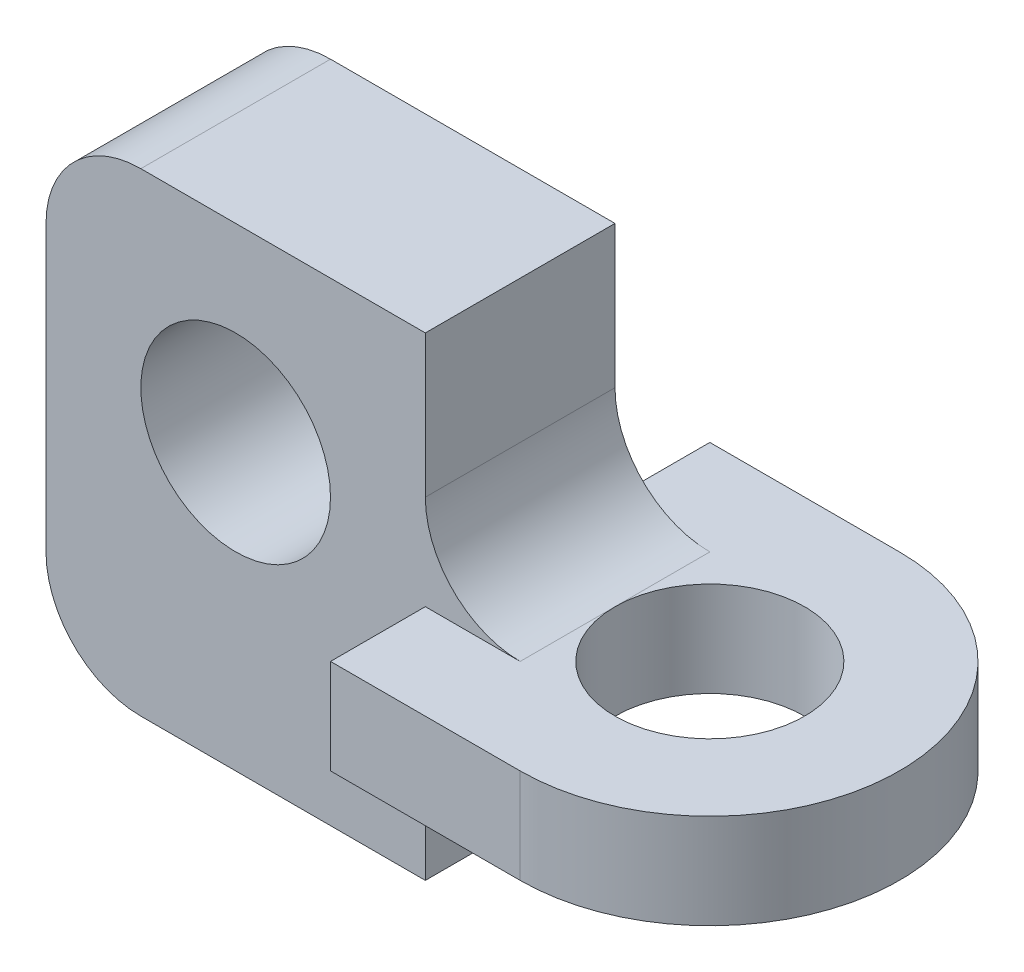
ISO-10303-21;
HEADER;
FILE_DESCRIPTION(('STEP AP214'),'2;1');
FILE_NAME('part.step','',(''),(''),'','','');
FILE_SCHEMA(('AUTOMOTIVE_DESIGN { 1 0 10303 214 1 1 1 1 }'));
ENDSEC;
DATA;
#1=APPLICATION_CONTEXT('core data for automotive mechanical design processes');
#2=APPLICATION_PROTOCOL_DEFINITION('international standard','automotive_design',2000,#1);
#3=PRODUCT_CONTEXT('',#1,'mechanical');
#4=PRODUCT('Part','Part','',(#3));
#5=PRODUCT_RELATED_PRODUCT_CATEGORY('part','',(#4));
#6=PRODUCT_DEFINITION_FORMATION('','',#4);
#7=PRODUCT_DEFINITION_CONTEXT('part definition',#1,'design');
#8=PRODUCT_DEFINITION('design','',#6,#7);
#9=PRODUCT_DEFINITION_SHAPE('','',#8);
#10=(LENGTH_UNIT() NAMED_UNIT(*) SI_UNIT(.MILLI.,.METRE.));
#11=(NAMED_UNIT(*) PLANE_ANGLE_UNIT() SI_UNIT($,.RADIAN.));
#12=(NAMED_UNIT(*) SI_UNIT($,.STERADIAN.) SOLID_ANGLE_UNIT());
#13=UNCERTAINTY_MEASURE_WITH_UNIT(LENGTH_MEASURE(1.E-05),#10,'distance_accuracy_value','');
#14=(GEOMETRIC_REPRESENTATION_CONTEXT(3) GLOBAL_UNCERTAINTY_ASSIGNED_CONTEXT((#13)) GLOBAL_UNIT_ASSIGNED_CONTEXT((#10,
#11,#12)) REPRESENTATION_CONTEXT('',''));
#15=CARTESIAN_POINT('',(0.,0.,0.));
#16=DIRECTION('',(0.,0.,1.));
#17=DIRECTION('',(1.,0.,0.));
#18=AXIS2_PLACEMENT_3D('',#15,#16,#17);
#19=CARTESIAN_POINT('',(-13.9576511057777,1.68484911129406,-2.));
#20=DIRECTION('',(1.,0.,0.));
#21=DIRECTION('',(0.,0.,-1.));
#22=AXIS2_PLACEMENT_3D('',#19,#20,#21);
#23=PLANE('',#22);
#24=DIRECTION('',(0.,1.,0.));
#25=VECTOR('',#24,1.);
#26=CARTESIAN_POINT('',(-13.9576511057777,-0.815150888705937,1.));
#27=LINE('',#26,#25);
#28=CARTESIAN_POINT('',(-13.9576511057777,0.684849111294063,1.));
#29=VERTEX_POINT('',#28);
#30=CARTESIAN_POINT('',(-13.9576511057777,1.68484911129406,1.));
#31=VERTEX_POINT('',#30);
#32=EDGE_CURVE('E190',#29,#31,#27,.T.);
#33=ORIENTED_EDGE('',*,*,#32,.F.);
#34=DIRECTION('',(0.,0.,1.));
#35=VECTOR('',#34,1.);
#36=CARTESIAN_POINT('',(-13.9576511057777,0.684849111294063,-2.));
#37=LINE('',#36,#35);
#38=CARTESIAN_POINT('',(-13.9576511057777,0.684849111294063,2.));
#39=VERTEX_POINT('',#38);
#40=EDGE_CURVE('E243',#29,#39,#37,.T.);
#41=ORIENTED_EDGE('',*,*,#40,.T.);
#42=DIRECTION('',(0.,-1.,0.));
#43=VECTOR('',#42,1.);
#44=CARTESIAN_POINT('',(-13.9576511057777,1.68484911129406,2.));
#45=LINE('',#44,#43);
#46=CARTESIAN_POINT('',(-13.9576511057777,1.68484911129406,2.));
#47=VERTEX_POINT('',#46);
#48=EDGE_CURVE('E250',#47,#39,#45,.T.);
#49=ORIENTED_EDGE('',*,*,#48,.F.);
#50=DIRECTION('',(0.,0.,1.));
#51=VECTOR('',#50,1.);
#52=CARTESIAN_POINT('',(-13.9576511057777,1.68484911129406,-2.));
#53=LINE('',#52,#51);
#54=EDGE_CURVE('E233',#31,#47,#53,.T.);
#55=ORIENTED_EDGE('',*,*,#54,.F.);
#56=EDGE_LOOP('',(#33,#41,#49,#55));
#57=FACE_BOUND('',#56,.T.);
#58=ADVANCED_FACE('F36',(#57),#23,.F.);
#59=CARTESIAN_POINT('',(-11.9576511057777,1.68484911129406,0.));
#60=DIRECTION('',(0.,1.,0.));
#61=DIRECTION('',(0.,0.,1.));
#62=AXIS2_PLACEMENT_3D('',#59,#60,#61);
#63=PLANE('',#62);
#64=DIRECTION('',(0.,0.,1.));
#65=VECTOR('',#64,1.);
#66=CARTESIAN_POINT('',(-12.9576511057777,1.68484911129406,0.));
#67=LINE('',#66,#65);
#68=CARTESIAN_POINT('',(-12.9576511057777,1.68484911129406,0.));
#69=VERTEX_POINT('',#68);
#70=CARTESIAN_POINT('',(-12.9576511057777,1.68484911129406,1.));
#71=VERTEX_POINT('',#70);
#72=EDGE_CURVE('E274',#69,#71,#67,.T.);
#73=ORIENTED_EDGE('',*,*,#72,.T.);
#74=DIRECTION('',(-1.,0.,0.));
#75=VECTOR('',#74,1.);
#76=CARTESIAN_POINT('',(-11.9576511057777,1.68484911129406,1.));
#77=LINE('',#76,#75);
#78=EDGE_CURVE('E277',#71,#31,#77,.T.);
#79=ORIENTED_EDGE('',*,*,#78,.T.);
#80=ORIENTED_EDGE('',*,*,#54,.T.);
#81=DIRECTION('',(1.,0.,0.));
#82=VECTOR('',#81,1.);
#83=CARTESIAN_POINT('',(-13.9576511057777,1.68484911129406,2.));
#84=LINE('',#83,#82);
#85=CARTESIAN_POINT('',(-11.9576511057777,1.68484911129406,2.));
#86=VERTEX_POINT('',#85);
#87=EDGE_CURVE('E236',#47,#86,#84,.T.);
#88=ORIENTED_EDGE('',*,*,#87,.T.);
#89=CARTESIAN_POINT('',(-11.9576511057777,1.68484911129406,0.));
#90=DIRECTION('',(0.,1.,0.));
#91=DIRECTION('',(0.,0.,1.));
#92=AXIS2_PLACEMENT_3D('',#89,#90,#91);
#93=CIRCLE('',#92,2.);
#94=CARTESIAN_POINT('',(-11.9576511057777,1.68484911129406,-2.));
#95=VERTEX_POINT('',#94);
#96=EDGE_CURVE('E227',#86,#95,#93,.T.);
#97=ORIENTED_EDGE('',*,*,#96,.T.);
#98=DIRECTION('',(-1.,0.,0.));
#99=VECTOR('',#98,1.);
#100=CARTESIAN_POINT('',(-11.9576511057777,1.68484911129406,-2.));
#101=LINE('',#100,#99);
#102=CARTESIAN_POINT('',(-13.9576511057777,1.68484911129406,-2.));
#103=VERTEX_POINT('',#102);
#104=EDGE_CURVE('E230',#95,#103,#101,.T.);
#105=ORIENTED_EDGE('',*,*,#104,.T.);
#106=CARTESIAN_POINT('',(-13.9576511057777,1.68484911129406,-1.));
#107=VERTEX_POINT('',#106);
#108=EDGE_CURVE('E234',#103,#107,#53,.T.);
#109=ORIENTED_EDGE('',*,*,#108,.T.);
#110=DIRECTION('',(1.,0.,0.));
#111=VECTOR('',#110,1.);
#112=CARTESIAN_POINT('',(-16.9576511057777,1.68484911129406,-1.));
#113=LINE('',#112,#111);
#114=CARTESIAN_POINT('',(-12.9576511057777,1.68484911129406,-1.));
#115=VERTEX_POINT('',#114);
#116=EDGE_CURVE('E50',#107,#115,#113,.T.);
#117=ORIENTED_EDGE('',*,*,#116,.T.);
#118=DIRECTION('',(0.,0.,1.));
#119=VECTOR('',#118,1.);
#120=CARTESIAN_POINT('',(-12.9576511057777,1.68484911129406,0.));
#121=LINE('',#120,#119);
#122=EDGE_CURVE('E271',#115,#69,#121,.T.);
#123=ORIENTED_EDGE('',*,*,#122,.T.);
#124=CARTESIAN_POINT('',(-11.9576511057777,1.68484911129406,0.));
#125=DIRECTION('',(0.,1.,0.));
#126=DIRECTION('',(0.,0.,1.));
#127=AXIS2_PLACEMENT_3D('',#124,#125,#126);
#128=CIRCLE('',#127,1.);
#129=EDGE_CURVE('E221',#69,#69,#128,.T.);
#130=ORIENTED_EDGE('',*,*,#129,.F.);
#131=EDGE_LOOP('',(#73,#79,#80,#88,#97,#105,#109,#117,#123,#130));
#132=FACE_BOUND('',#131,.T.);
#133=ADVANCED_FACE('F299',(#132),#63,.T.);
#134=CARTESIAN_POINT('',(-11.9576511057777,0.684849111294063,0.));
#135=DIRECTION('',(0.,1.,0.));
#136=DIRECTION('',(0.,0.,1.));
#137=AXIS2_PLACEMENT_3D('',#134,#135,#136);
#138=PLANE('',#137);
#139=ORIENTED_EDGE('',*,*,#40,.F.);
#140=DIRECTION('',(1.,0.,0.));
#141=VECTOR('',#140,1.);
#142=CARTESIAN_POINT('',(-16.9576511057777,0.684849111294063,1.));
#143=LINE('',#142,#141);
#144=CARTESIAN_POINT('',(-12.9576511057777,0.684849111294063,1.));
#145=VERTEX_POINT('',#144);
#146=EDGE_CURVE('E58',#29,#145,#143,.T.);
#147=ORIENTED_EDGE('',*,*,#146,.T.);
#148=DIRECTION('',(0.,0.,1.));
#149=VECTOR('',#148,1.);
#150=CARTESIAN_POINT('',(-12.9576511057777,0.684849111294063,-1.));
#151=LINE('',#150,#149);
#152=CARTESIAN_POINT('',(-12.9576511057777,0.684849111294063,0.));
#153=VERTEX_POINT('',#152);
#154=EDGE_CURVE('E267',#145,#153,#151,.F.);
#155=ORIENTED_EDGE('',*,*,#154,.T.);
#156=CARTESIAN_POINT('',(-11.9576511057777,0.684849111294063,0.));
#157=DIRECTION('',(0.,1.,0.));
#158=DIRECTION('',(0.,0.,1.));
#159=AXIS2_PLACEMENT_3D('',#156,#157,#158);
#160=CIRCLE('',#159,1.);
#161=EDGE_CURVE('E174',#153,#153,#160,.T.);
#162=ORIENTED_EDGE('',*,*,#161,.T.);
#163=DIRECTION('',(0.,0.,1.));
#164=VECTOR('',#163,1.);
#165=CARTESIAN_POINT('',(-12.9576511057777,0.684849111294063,-1.));
#166=LINE('',#165,#164);
#167=CARTESIAN_POINT('',(-12.9576511057777,0.684849111294063,-1.));
#168=VERTEX_POINT('',#167);
#169=EDGE_CURVE('E264',#153,#168,#166,.F.);
#170=ORIENTED_EDGE('',*,*,#169,.T.);
#171=DIRECTION('',(-1.,0.,0.));
#172=VECTOR('',#171,1.);
#173=CARTESIAN_POINT('',(-11.9576511057777,0.684849111294063,-1.));
#174=LINE('',#173,#172);
#175=CARTESIAN_POINT('',(-13.9576511057777,0.684849111294063,-1.));
#176=VERTEX_POINT('',#175);
#177=EDGE_CURVE('E262',#168,#176,#174,.T.);
#178=ORIENTED_EDGE('',*,*,#177,.T.);
#179=CARTESIAN_POINT('',(-13.9576511057777,0.684849111294063,-2.));
#180=VERTEX_POINT('',#179);
#181=EDGE_CURVE('E244',#180,#176,#37,.T.);
#182=ORIENTED_EDGE('',*,*,#181,.F.);
#183=DIRECTION('',(-1.,0.,0.));
#184=VECTOR('',#183,1.);
#185=CARTESIAN_POINT('',(-11.9576511057777,0.684849111294063,-2.));
#186=LINE('',#185,#184);
#187=CARTESIAN_POINT('',(-11.9576511057777,0.684849111294063,-2.));
#188=VERTEX_POINT('',#187);
#189=EDGE_CURVE('E241',#188,#180,#186,.T.);
#190=ORIENTED_EDGE('',*,*,#189,.F.);
#191=CARTESIAN_POINT('',(-11.9576511057777,0.684849111294063,0.));
#192=DIRECTION('',(0.,1.,0.));
#193=DIRECTION('',(0.,0.,1.));
#194=AXIS2_PLACEMENT_3D('',#191,#192,#193);
#195=CIRCLE('',#194,2.);
#196=CARTESIAN_POINT('',(-11.9576511057777,0.684849111294063,2.));
#197=VERTEX_POINT('',#196);
#198=EDGE_CURVE('E224',#197,#188,#195,.T.);
#199=ORIENTED_EDGE('',*,*,#198,.F.);
#200=DIRECTION('',(1.,0.,0.));
#201=VECTOR('',#200,1.);
#202=CARTESIAN_POINT('',(-13.9576511057777,0.684849111294063,2.));
#203=LINE('',#202,#201);
#204=EDGE_CURVE('E231',#39,#197,#203,.T.);
#205=ORIENTED_EDGE('',*,*,#204,.F.);
#206=EDGE_LOOP('',(#139,#147,#155,#162,#170,#178,#182,#190,#199,#205));
#207=FACE_BOUND('',#206,.T.);
#208=ADVANCED_FACE('F331',(#207),#138,.F.);
#209=CARTESIAN_POINT('',(-11.9576511057777,1.68484911129406,0.));
#210=DIRECTION('',(0.,-1.,0.));
#211=DIRECTION('',(0.,0.,-1.));
#212=AXIS2_PLACEMENT_3D('',#209,#210,#211);
#213=CYLINDRICAL_SURFACE('',#212,2.);
#214=ORIENTED_EDGE('',*,*,#198,.T.);
#215=DIRECTION('',(0.,-1.,0.));
#216=VECTOR('',#215,1.);
#217=CARTESIAN_POINT('',(-11.9576511057777,1.68484911129406,-2.));
#218=LINE('',#217,#216);
#219=EDGE_CURVE('E256',#95,#188,#218,.T.);
#220=ORIENTED_EDGE('',*,*,#219,.F.);
#221=ORIENTED_EDGE('',*,*,#96,.F.);
#222=DIRECTION('',(0.,-1.,0.));
#223=VECTOR('',#222,1.);
#224=CARTESIAN_POINT('',(-11.9576511057777,1.68484911129406,2.));
#225=LINE('',#224,#223);
#226=EDGE_CURVE('E238',#86,#197,#225,.T.);
#227=ORIENTED_EDGE('',*,*,#226,.T.);
#228=EDGE_LOOP('',(#214,#220,#221,#227));
#229=FACE_BOUND('',#228,.T.);
#230=ADVANCED_FACE('F345',(#229),#213,.T.);
#231=CARTESIAN_POINT('',(-11.9576511057777,1.68484911129406,-2.));
#232=DIRECTION('',(0.,0.,1.));
#233=DIRECTION('',(1.,0.,0.));
#234=AXIS2_PLACEMENT_3D('',#231,#232,#233);
#235=PLANE('',#234);
#236=ORIENTED_EDGE('',*,*,#189,.T.);
#237=DIRECTION('',(0.,-1.,0.));
#238=VECTOR('',#237,1.);
#239=CARTESIAN_POINT('',(-13.9576511057777,1.68484911129406,-2.));
#240=LINE('',#239,#238);
#241=EDGE_CURVE('E253',#103,#180,#240,.T.);
#242=ORIENTED_EDGE('',*,*,#241,.F.);
#243=ORIENTED_EDGE('',*,*,#104,.F.);
#244=ORIENTED_EDGE('',*,*,#219,.T.);
#245=EDGE_LOOP('',(#236,#242,#243,#244));
#246=FACE_BOUND('',#245,.T.);
#247=ADVANCED_FACE('F338',(#246),#235,.F.);
#248=ORIENTED_EDGE('',*,*,#181,.T.);
#249=DIRECTION('',(0.,1.,0.));
#250=VECTOR('',#249,1.);
#251=CARTESIAN_POINT('',(-13.9576511057777,4.18484911129406,-1.));
#252=LINE('',#251,#250);
#253=EDGE_CURVE('E206',#176,#107,#252,.T.);
#254=ORIENTED_EDGE('',*,*,#253,.T.);
#255=ORIENTED_EDGE('',*,*,#108,.F.);
#256=ORIENTED_EDGE('',*,*,#241,.T.);
#257=EDGE_LOOP('',(#248,#254,#255,#256));
#258=FACE_BOUND('',#257,.T.);
#259=ADVANCED_FACE('F305',(#258),#23,.F.);
#260=CARTESIAN_POINT('',(-13.9576511057777,1.68484911129406,2.));
#261=DIRECTION('',(0.,0.,-1.));
#262=DIRECTION('',(-1.,0.,0.));
#263=AXIS2_PLACEMENT_3D('',#260,#261,#262);
#264=PLANE('',#263);
#265=ORIENTED_EDGE('',*,*,#204,.T.);
#266=ORIENTED_EDGE('',*,*,#226,.F.);
#267=ORIENTED_EDGE('',*,*,#87,.F.);
#268=ORIENTED_EDGE('',*,*,#48,.T.);
#269=EDGE_LOOP('',(#265,#266,#267,#268));
#270=FACE_BOUND('',#269,.T.);
#271=ADVANCED_FACE('F337',(#270),#264,.F.);
#272=CARTESIAN_POINT('',(-11.9576511057777,1.68484911129406,0.));
#273=DIRECTION('',(0.,-1.,0.));
#274=DIRECTION('',(0.,0.,-1.));
#275=AXIS2_PLACEMENT_3D('',#272,#273,#274);
#276=CYLINDRICAL_SURFACE('',#275,1.);
#277=ORIENTED_EDGE('',*,*,#129,.T.);
#278=EDGE_LOOP('',(#277));
#279=FACE_BOUND('',#278,.T.);
#280=ORIENTED_EDGE('',*,*,#161,.F.);
#281=EDGE_LOOP('',(#280));
#282=FACE_BOUND('',#281,.T.);
#283=ADVANCED_FACE('F343',(#279,#282),#276,.F.);
#284=CARTESIAN_POINT('',(-13.9576511057777,4.18484911129406,1.));
#285=DIRECTION('',(-1.,0.,0.));
#286=DIRECTION('',(0.,-1.,0.));
#287=AXIS2_PLACEMENT_3D('',#284,#285,#286);
#288=PLANE('',#287);
#289=CARTESIAN_POINT('',(-13.9576511057777,-0.815150888705937,-1.));
#290=VERTEX_POINT('',#289);
#291=CARTESIAN_POINT('',(-13.9576511057777,-0.315150888705937,-1.));
#292=VERTEX_POINT('',#291);
#293=EDGE_CURVE('E202',#290,#292,#252,.T.);
#294=ORIENTED_EDGE('',*,*,#293,.T.);
#295=DIRECTION('',(0.,0.,1.));
#296=VECTOR('',#295,1.);
#297=CARTESIAN_POINT('',(-13.9576511057777,-0.315150888705937,1.));
#298=LINE('',#297,#296);
#299=CARTESIAN_POINT('',(-13.9576511057777,-0.315150888705937,1.));
#300=VERTEX_POINT('',#299);
#301=EDGE_CURVE('E259',#292,#300,#298,.T.);
#302=ORIENTED_EDGE('',*,*,#301,.T.);
#303=CARTESIAN_POINT('',(-13.9576511057777,-0.815150888705937,1.));
#304=VERTEX_POINT('',#303);
#305=EDGE_CURVE('E186',#304,#300,#27,.T.);
#306=ORIENTED_EDGE('',*,*,#305,.F.);
#307=DIRECTION('',(0.,0.,-1.));
#308=VECTOR('',#307,1.);
#309=CARTESIAN_POINT('',(-13.9576511057777,-0.815150888705937,1.));
#310=LINE('',#309,#308);
#311=EDGE_CURVE('E217',#304,#290,#310,.T.);
#312=ORIENTED_EDGE('',*,*,#311,.T.);
#313=EDGE_LOOP('',(#294,#302,#306,#312));
#314=FACE_BOUND('',#313,.T.);
#315=ADVANCED_FACE('F365',(#314),#288,.F.);
#316=CARTESIAN_POINT('',(-16.9576511057777,3.18484911129406,1.));
#317=DIRECTION('',(0.,0.,-1.));
#318=DIRECTION('',(-1.,0.,0.));
#319=AXIS2_PLACEMENT_3D('',#316,#317,#318);
#320=PLANE('',#319);
#321=DIRECTION('',(0.,-1.,0.));
#322=VECTOR('',#321,1.);
#323=CARTESIAN_POINT('',(-17.9576511057777,1.56450052341823,1.));
#324=LINE('',#323,#322);
#325=CARTESIAN_POINT('',(-17.9576511057777,3.18484911129406,1.));
#326=VERTEX_POINT('',#325);
#327=CARTESIAN_POINT('',(-17.9576511057777,0.18484911129407,1.));
#328=VERTEX_POINT('',#327);
#329=EDGE_CURVE('E154',#326,#328,#324,.T.);
#330=ORIENTED_EDGE('',*,*,#329,.T.);
#331=CARTESIAN_POINT('',(-16.9576511057777,0.184849111294063,1.));
#332=DIRECTION('',(0.,0.,1.));
#333=DIRECTION('',(1.,0.,0.));
#334=AXIS2_PLACEMENT_3D('',#331,#332,#333);
#335=CIRCLE('',#334,1.);
#336=CARTESIAN_POINT('',(-16.9576511057777,-0.815150888705937,1.));
#337=VERTEX_POINT('',#336);
#338=EDGE_CURVE('E159',#328,#337,#335,.T.);
#339=ORIENTED_EDGE('',*,*,#338,.T.);
#340=DIRECTION('',(1.,0.,0.));
#341=VECTOR('',#340,1.);
#342=CARTESIAN_POINT('',(-16.9576511057777,-0.815150888705937,1.));
#343=LINE('',#342,#341);
#344=EDGE_CURVE('E180',#337,#304,#343,.T.);
#345=ORIENTED_EDGE('',*,*,#344,.T.);
#346=ORIENTED_EDGE('',*,*,#305,.T.);
#347=CARTESIAN_POINT('',(-12.9576511057777,-0.315150888705937,1.));
#348=DIRECTION('',(0.,0.,-1.));
#349=DIRECTION('',(-1.,0.,0.));
#350=AXIS2_PLACEMENT_3D('',#347,#348,#349);
#351=CIRCLE('',#350,1.);
#352=EDGE_CURVE('E281',#300,#145,#351,.T.);
#353=ORIENTED_EDGE('',*,*,#352,.T.);
#354=ORIENTED_EDGE('',*,*,#146,.F.);
#355=ORIENTED_EDGE('',*,*,#32,.T.);
#356=ORIENTED_EDGE('',*,*,#78,.F.);
#357=CARTESIAN_POINT('',(-12.9576511057777,2.68484911129406,1.));
#358=DIRECTION('',(0.,0.,-1.));
#359=DIRECTION('',(-1.,0.,0.));
#360=AXIS2_PLACEMENT_3D('',#357,#358,#359);
#361=CIRCLE('',#360,1.);
#362=CARTESIAN_POINT('',(-13.9576511057777,2.68484911129406,1.));
#363=VERTEX_POINT('',#362);
#364=EDGE_CURVE('E44',#71,#363,#361,.T.);
#365=ORIENTED_EDGE('',*,*,#364,.T.);
#366=CARTESIAN_POINT('',(-13.9576511057777,4.18484911129406,1.));
#367=VERTEX_POINT('',#366);
#368=EDGE_CURVE('E182',#363,#367,#27,.T.);
#369=ORIENTED_EDGE('',*,*,#368,.T.);
#370=DIRECTION('',(-1.,0.,0.));
#371=VECTOR('',#370,1.);
#372=CARTESIAN_POINT('',(-16.9576511057777,4.18484911129406,1.));
#373=LINE('',#372,#371);
#374=CARTESIAN_POINT('',(-16.9576511057777,4.18484911129406,1.));
#375=VERTEX_POINT('',#374);
#376=EDGE_CURVE('E189',#367,#375,#373,.T.);
#377=ORIENTED_EDGE('',*,*,#376,.T.);
#378=CARTESIAN_POINT('',(-16.9576511057777,3.18484911129406,1.));
#379=DIRECTION('',(0.,0.,1.));
#380=DIRECTION('',(-1.,0.,0.));
#381=AXIS2_PLACEMENT_3D('',#378,#379,#380);
#382=CIRCLE('',#381,1.);
#383=EDGE_CURVE('E162',#375,#326,#382,.T.);
#384=ORIENTED_EDGE('',*,*,#383,.T.);
#385=EDGE_LOOP('',(#330,#339,#345,#346,#353,#354,#355,#356,#365,#369,#377,#384));
#386=FACE_BOUND('',#385,.T.);
#387=CARTESIAN_POINT('',(-15.9576511057777,2.18484911129406,1.));
#388=DIRECTION('',(0.,0.,1.));
#389=DIRECTION('',(1.,0.,0.));
#390=AXIS2_PLACEMENT_3D('',#387,#388,#389);
#391=CIRCLE('',#390,1.);
#392=CARTESIAN_POINT('',(-14.9576511057777,2.18484911129406,1.));
#393=VERTEX_POINT('',#392);
#394=EDGE_CURVE('E196',#393,#393,#391,.T.);
#395=ORIENTED_EDGE('',*,*,#394,.F.);
#396=EDGE_LOOP('',(#395));
#397=FACE_BOUND('',#396,.T.);
#398=ADVANCED_FACE('F156',(#386,#397),#320,.F.);
#399=CARTESIAN_POINT('',(-16.9576511057777,3.18484911129406,-1.));
#400=DIRECTION('',(0.,0.,-1.));
#401=DIRECTION('',(-1.,0.,0.));
#402=AXIS2_PLACEMENT_3D('',#399,#400,#401);
#403=PLANE('',#402);
#404=DIRECTION('',(0.,-1.,0.));
#405=VECTOR('',#404,1.);
#406=CARTESIAN_POINT('',(-17.9576511057777,1.56450052341823,-1.));
#407=LINE('',#406,#405);
#408=CARTESIAN_POINT('',(-17.9576511057777,3.18484911129406,-1.));
#409=VERTEX_POINT('',#408);
#410=CARTESIAN_POINT('',(-17.9576511057777,0.18484911129407,-1.));
#411=VERTEX_POINT('',#410);
#412=EDGE_CURVE('E171',#409,#411,#407,.T.);
#413=ORIENTED_EDGE('',*,*,#412,.F.);
#414=CARTESIAN_POINT('',(-16.9576511057777,3.18484911129406,-1.));
#415=DIRECTION('',(0.,0.,1.));
#416=DIRECTION('',(-1.,0.,0.));
#417=AXIS2_PLACEMENT_3D('',#414,#415,#416);
#418=CIRCLE('',#417,1.);
#419=CARTESIAN_POINT('',(-16.9576511057777,4.18484911129406,-1.));
#420=VERTEX_POINT('',#419);
#421=EDGE_CURVE('E166',#420,#409,#418,.T.);
#422=ORIENTED_EDGE('',*,*,#421,.F.);
#423=DIRECTION('',(-1.,0.,0.));
#424=VECTOR('',#423,1.);
#425=CARTESIAN_POINT('',(-16.9576511057777,4.18484911129406,-1.));
#426=LINE('',#425,#424);
#427=CARTESIAN_POINT('',(-13.9576511057777,4.18484911129406,-1.));
#428=VERTEX_POINT('',#427);
#429=EDGE_CURVE('E205',#428,#420,#426,.T.);
#430=ORIENTED_EDGE('',*,*,#429,.F.);
#431=CARTESIAN_POINT('',(-13.9576511057777,2.68484911129406,-1.));
#432=VERTEX_POINT('',#431);
#433=EDGE_CURVE('E201',#432,#428,#252,.T.);
#434=ORIENTED_EDGE('',*,*,#433,.F.);
#435=CARTESIAN_POINT('',(-12.9576511057777,2.68484911129406,-1.));
#436=DIRECTION('',(0.,0.,-1.));
#437=DIRECTION('',(-1.,0.,0.));
#438=AXIS2_PLACEMENT_3D('',#435,#436,#437);
#439=CIRCLE('',#438,1.);
#440=EDGE_CURVE('E11',#432,#115,#439,.F.);
#441=ORIENTED_EDGE('',*,*,#440,.T.);
#442=ORIENTED_EDGE('',*,*,#116,.F.);
#443=ORIENTED_EDGE('',*,*,#253,.F.);
#444=ORIENTED_EDGE('',*,*,#177,.F.);
#445=CARTESIAN_POINT('',(-12.9576511057777,-0.315150888705937,-1.));
#446=DIRECTION('',(0.,0.,-1.));
#447=DIRECTION('',(-1.,0.,0.));
#448=AXIS2_PLACEMENT_3D('',#445,#446,#447);
#449=CIRCLE('',#448,1.);
#450=EDGE_CURVE('E283',#168,#292,#449,.F.);
#451=ORIENTED_EDGE('',*,*,#450,.T.);
#452=ORIENTED_EDGE('',*,*,#293,.F.);
#453=DIRECTION('',(1.,0.,0.));
#454=VECTOR('',#453,1.);
#455=CARTESIAN_POINT('',(-16.9576511057777,-0.815150888705937,-1.));
#456=LINE('',#455,#454);
#457=CARTESIAN_POINT('',(-16.9576511057777,-0.815150888705937,-1.));
#458=VERTEX_POINT('',#457);
#459=EDGE_CURVE('E198',#458,#290,#456,.T.);
#460=ORIENTED_EDGE('',*,*,#459,.F.);
#461=CARTESIAN_POINT('',(-16.9576511057777,0.184849111294063,-1.));
#462=DIRECTION('',(0.,0.,1.));
#463=DIRECTION('',(1.,0.,0.));
#464=AXIS2_PLACEMENT_3D('',#461,#462,#463);
#465=CIRCLE('',#464,1.);
#466=EDGE_CURVE('E195',#411,#458,#465,.T.);
#467=ORIENTED_EDGE('',*,*,#466,.F.);
#468=EDGE_LOOP('',(#413,#422,#430,#434,#441,#442,#443,#444,#451,#452,#460,#467));
#469=FACE_BOUND('',#468,.T.);
#470=CARTESIAN_POINT('',(-15.9576511057777,2.18484911129406,-1.));
#471=DIRECTION('',(0.,0.,1.));
#472=DIRECTION('',(1.,0.,0.));
#473=AXIS2_PLACEMENT_3D('',#470,#471,#472);
#474=CIRCLE('',#473,1.);
#475=CARTESIAN_POINT('',(-14.9576511057777,2.18484911129406,-1.));
#476=VERTEX_POINT('',#475);
#477=EDGE_CURVE('E526',#476,#476,#474,.T.);
#478=ORIENTED_EDGE('',*,*,#477,.T.);
#479=EDGE_LOOP('',(#478));
#480=FACE_BOUND('',#479,.T.);
#481=ADVANCED_FACE('F295',(#469,#480),#403,.T.);
#482=CARTESIAN_POINT('',(-17.9576511057777,1.56450052341823,1.));
#483=DIRECTION('',(1.,0.,0.));
#484=DIRECTION('',(0.,1.,0.));
#485=AXIS2_PLACEMENT_3D('',#482,#483,#484);
#486=PLANE('',#485);
#487=ORIENTED_EDGE('',*,*,#412,.T.);
#488=DIRECTION('',(0.,0.,-1.));
#489=VECTOR('',#488,1.);
#490=CARTESIAN_POINT('',(-17.9576511057777,0.18484911129407,1.));
#491=LINE('',#490,#489);
#492=EDGE_CURVE('E169',#328,#411,#491,.T.);
#493=ORIENTED_EDGE('',*,*,#492,.F.);
#494=ORIENTED_EDGE('',*,*,#329,.F.);
#495=DIRECTION('',(0.,0.,-1.));
#496=VECTOR('',#495,1.);
#497=CARTESIAN_POINT('',(-17.9576511057777,3.18484911129406,1.));
#498=LINE('',#497,#496);
#499=EDGE_CURVE('E193',#326,#409,#498,.T.);
#500=ORIENTED_EDGE('',*,*,#499,.T.);
#501=EDGE_LOOP('',(#487,#493,#494,#500));
#502=FACE_BOUND('',#501,.T.);
#503=ADVANCED_FACE('F170',(#502),#486,.F.);
#504=CARTESIAN_POINT('',(-16.9576511057777,0.184849111294063,1.));
#505=DIRECTION('',(0.,0.,-1.));
#506=DIRECTION('',(-1.,0.,0.));
#507=AXIS2_PLACEMENT_3D('',#504,#505,#506);
#508=CYLINDRICAL_SURFACE('',#507,1.);
#509=ORIENTED_EDGE('',*,*,#466,.T.);
#510=DIRECTION('',(0.,0.,-1.));
#511=VECTOR('',#510,1.);
#512=CARTESIAN_POINT('',(-16.9576511057777,-0.815150888705937,1.));
#513=LINE('',#512,#511);
#514=EDGE_CURVE('E175',#337,#458,#513,.T.);
#515=ORIENTED_EDGE('',*,*,#514,.F.);
#516=ORIENTED_EDGE('',*,*,#338,.F.);
#517=ORIENTED_EDGE('',*,*,#492,.T.);
#518=EDGE_LOOP('',(#509,#515,#516,#517));
#519=FACE_BOUND('',#518,.T.);
#520=ADVANCED_FACE('F177',(#519),#508,.T.);
#521=CARTESIAN_POINT('',(-16.9576511057777,-0.815150888705937,1.));
#522=DIRECTION('',(0.,1.,0.));
#523=DIRECTION('',(0.,0.,1.));
#524=AXIS2_PLACEMENT_3D('',#521,#522,#523);
#525=PLANE('',#524);
#526=ORIENTED_EDGE('',*,*,#459,.T.);
#527=ORIENTED_EDGE('',*,*,#311,.F.);
#528=ORIENTED_EDGE('',*,*,#344,.F.);
#529=ORIENTED_EDGE('',*,*,#514,.T.);
#530=EDGE_LOOP('',(#526,#527,#528,#529));
#531=FACE_BOUND('',#530,.T.);
#532=ADVANCED_FACE('F443',(#531),#525,.F.);
#533=ORIENTED_EDGE('',*,*,#368,.F.);
#534=DIRECTION('',(0.,0.,1.));
#535=VECTOR('',#534,1.);
#536=CARTESIAN_POINT('',(-13.9576511057777,2.68484911129406,1.));
#537=LINE('',#536,#535);
#538=EDGE_CURVE('E279',#363,#432,#537,.F.);
#539=ORIENTED_EDGE('',*,*,#538,.T.);
#540=ORIENTED_EDGE('',*,*,#433,.T.);
#541=DIRECTION('',(0.,0.,-1.));
#542=VECTOR('',#541,1.);
#543=CARTESIAN_POINT('',(-13.9576511057777,4.18484911129406,1.));
#544=LINE('',#543,#542);
#545=EDGE_CURVE('E214',#367,#428,#544,.T.);
#546=ORIENTED_EDGE('',*,*,#545,.F.);
#547=EDGE_LOOP('',(#533,#539,#540,#546));
#548=FACE_BOUND('',#547,.T.);
#549=ADVANCED_FACE('F290',(#548),#288,.F.);
#550=CARTESIAN_POINT('',(-16.9576511057777,4.18484911129406,1.));
#551=DIRECTION('',(0.,-1.,0.));
#552=DIRECTION('',(0.,0.,-1.));
#553=AXIS2_PLACEMENT_3D('',#550,#551,#552);
#554=PLANE('',#553);
#555=ORIENTED_EDGE('',*,*,#429,.T.);
#556=DIRECTION('',(0.,0.,-1.));
#557=VECTOR('',#556,1.);
#558=CARTESIAN_POINT('',(-16.9576511057777,4.18484911129406,1.));
#559=LINE('',#558,#557);
#560=EDGE_CURVE('E211',#375,#420,#559,.T.);
#561=ORIENTED_EDGE('',*,*,#560,.F.);
#562=ORIENTED_EDGE('',*,*,#376,.F.);
#563=ORIENTED_EDGE('',*,*,#545,.T.);
#564=EDGE_LOOP('',(#555,#561,#562,#563));
#565=FACE_BOUND('',#564,.T.);
#566=ADVANCED_FACE('F308',(#565),#554,.F.);
#567=CARTESIAN_POINT('',(-16.9576511057777,3.18484911129406,1.));
#568=DIRECTION('',(0.,0.,-1.));
#569=DIRECTION('',(-1.,0.,0.));
#570=AXIS2_PLACEMENT_3D('',#567,#568,#569);
#571=CYLINDRICAL_SURFACE('',#570,1.);
#572=ORIENTED_EDGE('',*,*,#421,.T.);
#573=ORIENTED_EDGE('',*,*,#499,.F.);
#574=ORIENTED_EDGE('',*,*,#383,.F.);
#575=ORIENTED_EDGE('',*,*,#560,.T.);
#576=EDGE_LOOP('',(#572,#573,#574,#575));
#577=FACE_BOUND('',#576,.T.);
#578=ADVANCED_FACE('F312',(#577),#571,.T.);
#579=CARTESIAN_POINT('',(-15.9576511057777,2.18484911129406,1.));
#580=DIRECTION('',(0.,0.,-1.));
#581=DIRECTION('',(-1.,0.,0.));
#582=AXIS2_PLACEMENT_3D('',#579,#580,#581);
#583=CYLINDRICAL_SURFACE('',#582,1.);
#584=ORIENTED_EDGE('',*,*,#394,.T.);
#585=EDGE_LOOP('',(#584));
#586=FACE_BOUND('',#585,.T.);
#587=ORIENTED_EDGE('',*,*,#477,.F.);
#588=EDGE_LOOP('',(#587));
#589=FACE_BOUND('',#588,.T.);
#590=ADVANCED_FACE('F314',(#586,#589),#583,.F.);
#591=CARTESIAN_POINT('',(-12.9576511057777,-0.315150888705937,1.));
#592=DIRECTION('',(0.,0.,-1.));
#593=DIRECTION('',(-1.,0.,0.));
#594=AXIS2_PLACEMENT_3D('',#591,#592,#593);
#595=CYLINDRICAL_SURFACE('',#594,1.);
#596=ORIENTED_EDGE('',*,*,#169,.F.);
#597=ORIENTED_EDGE('',*,*,#154,.F.);
#598=ORIENTED_EDGE('',*,*,#352,.F.);
#599=ORIENTED_EDGE('',*,*,#301,.F.);
#600=ORIENTED_EDGE('',*,*,#450,.F.);
#601=EDGE_LOOP('',(#596,#597,#598,#599,#600));
#602=FACE_BOUND('',#601,.T.);
#603=ADVANCED_FACE('F320',(#602),#595,.F.);
#604=CARTESIAN_POINT('',(-12.9576511057777,2.68484911129406,0.));
#605=DIRECTION('',(0.,0.,1.));
#606=DIRECTION('',(1.,0.,0.));
#607=AXIS2_PLACEMENT_3D('',#604,#605,#606);
#608=CYLINDRICAL_SURFACE('',#607,1.);
#609=ORIENTED_EDGE('',*,*,#440,.F.);
#610=ORIENTED_EDGE('',*,*,#538,.F.);
#611=ORIENTED_EDGE('',*,*,#364,.F.);
#612=ORIENTED_EDGE('',*,*,#72,.F.);
#613=ORIENTED_EDGE('',*,*,#122,.F.);
#614=EDGE_LOOP('',(#609,#610,#611,#612,#613));
#615=FACE_BOUND('',#614,.T.);
#616=ADVANCED_FACE('F38',(#615),#608,.F.);
#617=CLOSED_SHELL('',(#58,#133,#208,#230,#247,#259,#271,#283,#315,#398,#481,#503,#520,#532,#549,
#566,#578,#590,#603,#616));
#618=MANIFOLD_SOLID_BREP('B2',#617);
#619=ADVANCED_BREP_SHAPE_REPRESENTATION('',(#18,#618),#14);
#620=SHAPE_DEFINITION_REPRESENTATION(#9,#619);
ENDSEC;
END-ISO-10303-21;
